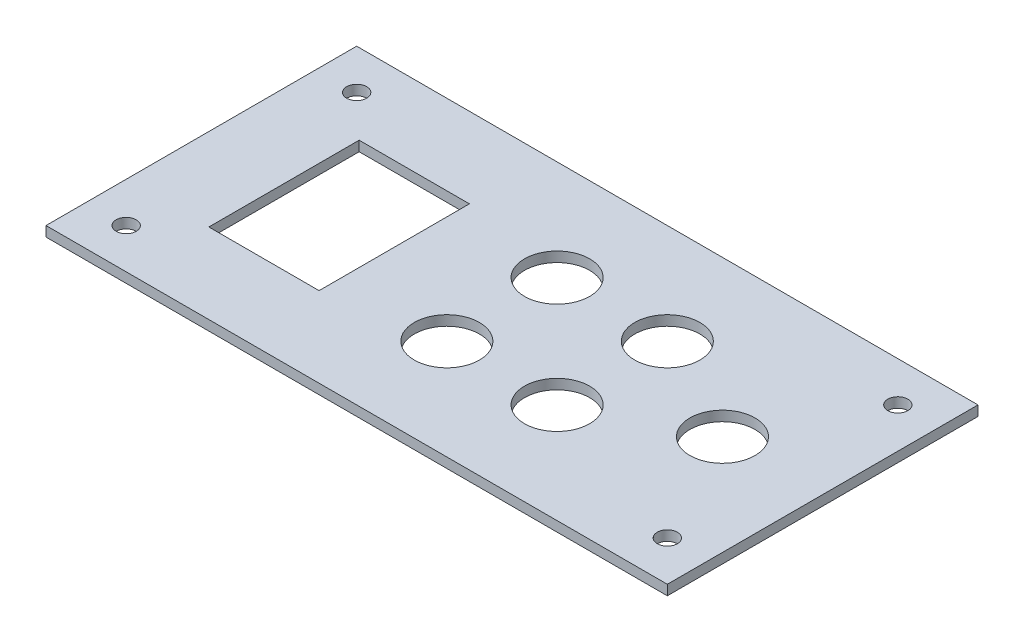
ISO-10303-21;
HEADER;
FILE_DESCRIPTION(('STEP AP214'),'2;1');
FILE_NAME('part.step','',(''),(''),'','','');
FILE_SCHEMA(('AUTOMOTIVE_DESIGN { 1 0 10303 214 1 1 1 1 }'));
ENDSEC;
DATA;
#1=APPLICATION_CONTEXT('core data for automotive mechanical design processes');
#2=APPLICATION_PROTOCOL_DEFINITION('international standard','automotive_design',2000,#1);
#3=PRODUCT_CONTEXT('',#1,'mechanical');
#4=PRODUCT('Part','Part','',(#3));
#5=PRODUCT_RELATED_PRODUCT_CATEGORY('part','',(#4));
#6=PRODUCT_DEFINITION_FORMATION('','',#4);
#7=PRODUCT_DEFINITION_CONTEXT('part definition',#1,'design');
#8=PRODUCT_DEFINITION('design','',#6,#7);
#9=PRODUCT_DEFINITION_SHAPE('','',#8);
#10=(LENGTH_UNIT() NAMED_UNIT(*) SI_UNIT(.MILLI.,.METRE.));
#11=(NAMED_UNIT(*) PLANE_ANGLE_UNIT() SI_UNIT($,.RADIAN.));
#12=(NAMED_UNIT(*) SI_UNIT($,.STERADIAN.) SOLID_ANGLE_UNIT());
#13=UNCERTAINTY_MEASURE_WITH_UNIT(LENGTH_MEASURE(1.E-05),#10,'distance_accuracy_value','');
#14=(GEOMETRIC_REPRESENTATION_CONTEXT(3) GLOBAL_UNCERTAINTY_ASSIGNED_CONTEXT((#13)) GLOBAL_UNIT_ASSIGNED_CONTEXT((#10,
#11,#12)) REPRESENTATION_CONTEXT('',''));
#15=CARTESIAN_POINT('',(0.,0.,0.));
#16=DIRECTION('',(0.,0.,1.));
#17=DIRECTION('',(1.,0.,0.));
#18=AXIS2_PLACEMENT_3D('',#15,#16,#17);
#19=CARTESIAN_POINT('',(0.,2.,0.));
#20=DIRECTION('',(0.,1.,0.));
#21=DIRECTION('',(0.,0.,1.));
#22=AXIS2_PLACEMENT_3D('',#19,#20,#21);
#23=PLANE('',#22);
#24=CARTESIAN_POINT('',(68.5,2.,23.));
#25=DIRECTION('',(0.,1.,0.));
#26=DIRECTION('',(0.,0.,-1.));
#27=AXIS2_PLACEMENT_3D('',#24,#25,#26);
#28=CIRCLE('',#27,2.);
#29=CARTESIAN_POINT('',(68.5,2.,21.));
#30=VERTEX_POINT('',#29);
#31=EDGE_CURVE('E315',#30,#30,#28,.T.);
#32=ORIENTED_EDGE('',*,*,#31,.F.);
#33=EDGE_LOOP('',(#32));
#34=FACE_BOUND('',#33,.T.);
#35=CARTESIAN_POINT('',(-39.5,2.,-23.));
#36=DIRECTION('',(0.,1.,0.));
#37=DIRECTION('',(0.,0.,1.));
#38=AXIS2_PLACEMENT_3D('',#35,#36,#37);
#39=CIRCLE('',#38,2.);
#40=CARTESIAN_POINT('',(-39.5,2.,-21.));
#41=VERTEX_POINT('',#40);
#42=EDGE_CURVE('E127',#41,#41,#39,.T.);
#43=ORIENTED_EDGE('',*,*,#42,.F.);
#44=EDGE_LOOP('',(#43));
#45=FACE_BOUND('',#44,.T.);
#46=CARTESIAN_POINT('',(34.5,2.,-11.));
#47=DIRECTION('',(0.,1.,0.));
#48=DIRECTION('',(0.,0.,1.));
#49=AXIS2_PLACEMENT_3D('',#46,#47,#48);
#50=CIRCLE('',#49,6.5);
#51=CARTESIAN_POINT('',(34.5,2.,-4.5));
#52=VERTEX_POINT('',#51);
#53=EDGE_CURVE('E143',#52,#52,#50,.T.);
#54=ORIENTED_EDGE('',*,*,#53,.F.);
#55=EDGE_LOOP('',(#54));
#56=FACE_BOUND('',#55,.T.);
#57=CARTESIAN_POINT('',(12.5,2.,11.));
#58=DIRECTION('',(0.,1.,0.));
#59=DIRECTION('',(0.,0.,1.));
#60=AXIS2_PLACEMENT_3D('',#57,#58,#59);
#61=CIRCLE('',#60,6.5);
#62=CARTESIAN_POINT('',(12.5,2.,17.5));
#63=VERTEX_POINT('',#62);
#64=EDGE_CURVE('E155',#63,#63,#61,.T.);
#65=ORIENTED_EDGE('',*,*,#64,.F.);
#66=EDGE_LOOP('',(#65));
#67=FACE_BOUND('',#66,.T.);
#68=DIRECTION('',(0.,0.,1.));
#69=VECTOR('',#68,1.);
#70=CARTESIAN_POINT('',(-47.5,2.,-31.));
#71=LINE('',#70,#69);
#72=CARTESIAN_POINT('',(-47.5,2.,-31.));
#73=VERTEX_POINT('',#72);
#74=CARTESIAN_POINT('',(-47.5,2.,31.));
#75=VERTEX_POINT('',#74);
#76=EDGE_CURVE('E167',#73,#75,#71,.T.);
#77=ORIENTED_EDGE('',*,*,#76,.T.);
#78=DIRECTION('',(1.,0.,0.));
#79=VECTOR('',#78,1.);
#80=CARTESIAN_POINT('',(-47.5,2.,31.));
#81=LINE('',#80,#79);
#82=CARTESIAN_POINT('',(76.5,2.,31.));
#83=VERTEX_POINT('',#82);
#84=EDGE_CURVE('E170',#75,#83,#81,.T.);
#85=ORIENTED_EDGE('',*,*,#84,.T.);
#86=DIRECTION('',(0.,0.,-1.));
#87=VECTOR('',#86,1.);
#88=CARTESIAN_POINT('',(76.5,2.,-31.));
#89=LINE('',#88,#87);
#90=CARTESIAN_POINT('',(76.5,2.,-31.));
#91=VERTEX_POINT('',#90);
#92=EDGE_CURVE('E173',#83,#91,#89,.T.);
#93=ORIENTED_EDGE('',*,*,#92,.T.);
#94=DIRECTION('',(-1.,0.,0.));
#95=VECTOR('',#94,1.);
#96=CARTESIAN_POINT('',(-47.5,2.,-31.));
#97=LINE('',#96,#95);
#98=EDGE_CURVE('E175',#91,#73,#97,.T.);
#99=ORIENTED_EDGE('',*,*,#98,.T.);
#100=EDGE_LOOP('',(#77,#85,#93,#99));
#101=FACE_BOUND('',#100,.T.);
#102=CARTESIAN_POINT('',(12.5,2.,-11.));
#103=DIRECTION('',(0.,1.,0.));
#104=DIRECTION('',(0.,0.,1.));
#105=AXIS2_PLACEMENT_3D('',#102,#103,#104);
#106=CIRCLE('',#105,6.5);
#107=CARTESIAN_POINT('',(12.5,2.,-4.5));
#108=VERTEX_POINT('',#107);
#109=EDGE_CURVE('E161',#108,#108,#106,.T.);
#110=ORIENTED_EDGE('',*,*,#109,.F.);
#111=EDGE_LOOP('',(#110));
#112=FACE_BOUND('',#111,.T.);
#113=CARTESIAN_POINT('',(56.5,2.,0.));
#114=DIRECTION('',(0.,1.,0.));
#115=DIRECTION('',(0.,0.,1.));
#116=AXIS2_PLACEMENT_3D('',#113,#114,#115);
#117=CIRCLE('',#116,6.5);
#118=CARTESIAN_POINT('',(56.5,2.,6.5));
#119=VERTEX_POINT('',#118);
#120=EDGE_CURVE('E149',#119,#119,#117,.T.);
#121=ORIENTED_EDGE('',*,*,#120,.F.);
#122=EDGE_LOOP('',(#121));
#123=FACE_BOUND('',#122,.T.);
#124=CARTESIAN_POINT('',(34.5,2.,11.));
#125=DIRECTION('',(0.,1.,0.));
#126=DIRECTION('',(0.,0.,1.));
#127=AXIS2_PLACEMENT_3D('',#124,#125,#126);
#128=CIRCLE('',#127,6.5);
#129=CARTESIAN_POINT('',(34.5,2.,17.5));
#130=VERTEX_POINT('',#129);
#131=EDGE_CURVE('E137',#130,#130,#128,.T.);
#132=ORIENTED_EDGE('',*,*,#131,.F.);
#133=EDGE_LOOP('',(#132));
#134=FACE_BOUND('',#133,.T.);
#135=DIRECTION('',(-1.,0.,0.));
#136=VECTOR('',#135,1.);
#137=CARTESIAN_POINT('',(-31.,2.,-15.));
#138=LINE('',#137,#136);
#139=CARTESIAN_POINT('',(-9.00000000000001,2.,-15.));
#140=VERTEX_POINT('',#139);
#141=CARTESIAN_POINT('',(-31.,2.,-15.));
#142=VERTEX_POINT('',#141);
#143=EDGE_CURVE('E106',#140,#142,#138,.T.);
#144=ORIENTED_EDGE('',*,*,#143,.F.);
#145=DIRECTION('',(0.,0.,-1.));
#146=VECTOR('',#145,1.);
#147=CARTESIAN_POINT('',(-9.00000000000001,2.,-15.));
#148=LINE('',#147,#146);
#149=CARTESIAN_POINT('',(-9.00000000000001,2.,15.));
#150=VERTEX_POINT('',#149);
#151=EDGE_CURVE('E98',#150,#140,#148,.T.);
#152=ORIENTED_EDGE('',*,*,#151,.F.);
#153=DIRECTION('',(1.,0.,0.));
#154=VECTOR('',#153,1.);
#155=CARTESIAN_POINT('',(-31.,2.,15.));
#156=LINE('',#155,#154);
#157=CARTESIAN_POINT('',(-31.,2.,15.));
#158=VERTEX_POINT('',#157);
#159=EDGE_CURVE('E121',#158,#150,#156,.T.);
#160=ORIENTED_EDGE('',*,*,#159,.F.);
#161=DIRECTION('',(0.,0.,1.));
#162=VECTOR('',#161,1.);
#163=CARTESIAN_POINT('',(-31.,2.,-15.));
#164=LINE('',#163,#162);
#165=EDGE_CURVE('E119',#142,#158,#164,.T.);
#166=ORIENTED_EDGE('',*,*,#165,.F.);
#167=EDGE_LOOP('',(#144,#152,#160,#166));
#168=FACE_BOUND('',#167,.T.);
#169=CARTESIAN_POINT('',(68.5,2.,-23.));
#170=DIRECTION('',(0.,1.,0.));
#171=DIRECTION('',(0.,0.,1.));
#172=AXIS2_PLACEMENT_3D('',#169,#170,#171);
#173=CIRCLE('',#172,2.);
#174=CARTESIAN_POINT('',(68.5,2.,-21.));
#175=VERTEX_POINT('',#174);
#176=EDGE_CURVE('E321',#175,#175,#173,.T.);
#177=ORIENTED_EDGE('',*,*,#176,.F.);
#178=EDGE_LOOP('',(#177));
#179=FACE_BOUND('',#178,.T.);
#180=CARTESIAN_POINT('',(-39.5,2.,23.));
#181=DIRECTION('',(0.,1.,0.));
#182=DIRECTION('',(0.,0.,-1.));
#183=AXIS2_PLACEMENT_3D('',#180,#181,#182);
#184=CIRCLE('',#183,2.);
#185=CARTESIAN_POINT('',(-39.5,2.,21.));
#186=VERTEX_POINT('',#185);
#187=EDGE_CURVE('E306',#186,#186,#184,.T.);
#188=ORIENTED_EDGE('',*,*,#187,.F.);
#189=EDGE_LOOP('',(#188));
#190=FACE_BOUND('',#189,.T.);
#191=ADVANCED_FACE('F33',(#34,#45,#56,#67,#101,#112,#123,#134,#168,#179,#190),#23,.T.);
#192=CARTESIAN_POINT('',(0.,0.,0.));
#193=DIRECTION('',(0.,1.,0.));
#194=DIRECTION('',(0.,0.,1.));
#195=AXIS2_PLACEMENT_3D('',#192,#193,#194);
#196=PLANE('',#195);
#197=CARTESIAN_POINT('',(34.5,0.,11.));
#198=DIRECTION('',(0.,1.,0.));
#199=DIRECTION('',(0.,0.,1.));
#200=AXIS2_PLACEMENT_3D('',#197,#198,#199);
#201=CIRCLE('',#200,6.5);
#202=CARTESIAN_POINT('',(34.5,0.,17.5));
#203=VERTEX_POINT('',#202);
#204=EDGE_CURVE('E114',#203,#203,#201,.T.);
#205=ORIENTED_EDGE('',*,*,#204,.T.);
#206=EDGE_LOOP('',(#205));
#207=FACE_BOUND('',#206,.T.);
#208=CARTESIAN_POINT('',(34.5,0.,-11.));
#209=DIRECTION('',(0.,1.,0.));
#210=DIRECTION('',(0.,0.,1.));
#211=AXIS2_PLACEMENT_3D('',#208,#209,#210);
#212=CIRCLE('',#211,6.5);
#213=CARTESIAN_POINT('',(34.5,0.,-4.5));
#214=VERTEX_POINT('',#213);
#215=EDGE_CURVE('E140',#214,#214,#212,.T.);
#216=ORIENTED_EDGE('',*,*,#215,.T.);
#217=EDGE_LOOP('',(#216));
#218=FACE_BOUND('',#217,.T.);
#219=CARTESIAN_POINT('',(56.5,0.,0.));
#220=DIRECTION('',(0.,1.,0.));
#221=DIRECTION('',(0.,0.,1.));
#222=AXIS2_PLACEMENT_3D('',#219,#220,#221);
#223=CIRCLE('',#222,6.5);
#224=CARTESIAN_POINT('',(56.5,0.,6.5));
#225=VERTEX_POINT('',#224);
#226=EDGE_CURVE('E146',#225,#225,#223,.T.);
#227=ORIENTED_EDGE('',*,*,#226,.T.);
#228=EDGE_LOOP('',(#227));
#229=FACE_BOUND('',#228,.T.);
#230=CARTESIAN_POINT('',(12.5,0.,11.));
#231=DIRECTION('',(0.,1.,0.));
#232=DIRECTION('',(0.,0.,1.));
#233=AXIS2_PLACEMENT_3D('',#230,#231,#232);
#234=CIRCLE('',#233,6.5);
#235=CARTESIAN_POINT('',(12.5,0.,17.5));
#236=VERTEX_POINT('',#235);
#237=EDGE_CURVE('E152',#236,#236,#234,.T.);
#238=ORIENTED_EDGE('',*,*,#237,.T.);
#239=EDGE_LOOP('',(#238));
#240=FACE_BOUND('',#239,.T.);
#241=CARTESIAN_POINT('',(12.5,0.,-11.));
#242=DIRECTION('',(0.,1.,0.));
#243=DIRECTION('',(0.,0.,1.));
#244=AXIS2_PLACEMENT_3D('',#241,#242,#243);
#245=CIRCLE('',#244,6.5);
#246=CARTESIAN_POINT('',(12.5,0.,-4.5));
#247=VERTEX_POINT('',#246);
#248=EDGE_CURVE('E158',#247,#247,#245,.T.);
#249=ORIENTED_EDGE('',*,*,#248,.T.);
#250=EDGE_LOOP('',(#249));
#251=FACE_BOUND('',#250,.T.);
#252=DIRECTION('',(0.,0.,1.));
#253=VECTOR('',#252,1.);
#254=CARTESIAN_POINT('',(-47.5,0.,-31.));
#255=LINE('',#254,#253);
#256=CARTESIAN_POINT('',(-47.5,0.,-31.));
#257=VERTEX_POINT('',#256);
#258=CARTESIAN_POINT('',(-47.5,0.,31.));
#259=VERTEX_POINT('',#258);
#260=EDGE_CURVE('E164',#257,#259,#255,.T.);
#261=ORIENTED_EDGE('',*,*,#260,.F.);
#262=DIRECTION('',(-1.,0.,0.));
#263=VECTOR('',#262,1.);
#264=CARTESIAN_POINT('',(-47.5,0.,-31.));
#265=LINE('',#264,#263);
#266=CARTESIAN_POINT('',(76.5,0.,-31.));
#267=VERTEX_POINT('',#266);
#268=EDGE_CURVE('E171',#267,#257,#265,.T.);
#269=ORIENTED_EDGE('',*,*,#268,.F.);
#270=DIRECTION('',(0.,0.,-1.));
#271=VECTOR('',#270,1.);
#272=CARTESIAN_POINT('',(76.5,0.,-31.));
#273=LINE('',#272,#271);
#274=CARTESIAN_POINT('',(76.5,0.,31.));
#275=VERTEX_POINT('',#274);
#276=EDGE_CURVE('E182',#275,#267,#273,.T.);
#277=ORIENTED_EDGE('',*,*,#276,.F.);
#278=DIRECTION('',(1.,0.,0.));
#279=VECTOR('',#278,1.);
#280=CARTESIAN_POINT('',(-47.5,0.,31.));
#281=LINE('',#280,#279);
#282=EDGE_CURVE('E180',#259,#275,#281,.T.);
#283=ORIENTED_EDGE('',*,*,#282,.F.);
#284=EDGE_LOOP('',(#261,#269,#277,#283));
#285=FACE_BOUND('',#284,.T.);
#286=DIRECTION('',(0.,0.,-1.));
#287=VECTOR('',#286,1.);
#288=CARTESIAN_POINT('',(-9.00000000000001,0.,-15.));
#289=LINE('',#288,#287);
#290=CARTESIAN_POINT('',(-9.00000000000001,0.,15.));
#291=VERTEX_POINT('',#290);
#292=CARTESIAN_POINT('',(-9.00000000000001,0.,-15.));
#293=VERTEX_POINT('',#292);
#294=EDGE_CURVE('E56',#291,#293,#289,.T.);
#295=ORIENTED_EDGE('',*,*,#294,.T.);
#296=DIRECTION('',(-1.,0.,0.));
#297=VECTOR('',#296,1.);
#298=CARTESIAN_POINT('',(-31.,0.,-15.));
#299=LINE('',#298,#297);
#300=CARTESIAN_POINT('',(-31.,0.,-15.));
#301=VERTEX_POINT('',#300);
#302=EDGE_CURVE('E113',#293,#301,#299,.T.);
#303=ORIENTED_EDGE('',*,*,#302,.T.);
#304=DIRECTION('',(0.,0.,1.));
#305=VECTOR('',#304,1.);
#306=CARTESIAN_POINT('',(-31.,0.,-15.));
#307=LINE('',#306,#305);
#308=CARTESIAN_POINT('',(-31.,0.,15.));
#309=VERTEX_POINT('',#308);
#310=EDGE_CURVE('E129',#301,#309,#307,.T.);
#311=ORIENTED_EDGE('',*,*,#310,.T.);
#312=DIRECTION('',(1.,0.,0.));
#313=VECTOR('',#312,1.);
#314=CARTESIAN_POINT('',(-31.,0.,15.));
#315=LINE('',#314,#313);
#316=EDGE_CURVE('E107',#309,#291,#315,.T.);
#317=ORIENTED_EDGE('',*,*,#316,.T.);
#318=EDGE_LOOP('',(#295,#303,#311,#317));
#319=FACE_BOUND('',#318,.T.);
#320=CARTESIAN_POINT('',(-39.5,0.,-23.));
#321=DIRECTION('',(0.,1.,0.));
#322=DIRECTION('',(0.,0.,1.));
#323=AXIS2_PLACEMENT_3D('',#320,#321,#322);
#324=CIRCLE('',#323,2.);
#325=CARTESIAN_POINT('',(-39.5,0.,-21.));
#326=VERTEX_POINT('',#325);
#327=EDGE_CURVE('E324',#326,#326,#324,.T.);
#328=ORIENTED_EDGE('',*,*,#327,.T.);
#329=EDGE_LOOP('',(#328));
#330=FACE_BOUND('',#329,.T.);
#331=CARTESIAN_POINT('',(68.5,0.,-23.));
#332=DIRECTION('',(0.,1.,0.));
#333=DIRECTION('',(0.,0.,1.));
#334=AXIS2_PLACEMENT_3D('',#331,#332,#333);
#335=CIRCLE('',#334,2.);
#336=CARTESIAN_POINT('',(68.5,0.,-21.));
#337=VERTEX_POINT('',#336);
#338=EDGE_CURVE('E318',#337,#337,#335,.T.);
#339=ORIENTED_EDGE('',*,*,#338,.T.);
#340=EDGE_LOOP('',(#339));
#341=FACE_BOUND('',#340,.T.);
#342=CARTESIAN_POINT('',(68.5,0.,23.));
#343=DIRECTION('',(0.,1.,0.));
#344=DIRECTION('',(0.,0.,-1.));
#345=AXIS2_PLACEMENT_3D('',#342,#343,#344);
#346=CIRCLE('',#345,2.);
#347=CARTESIAN_POINT('',(68.5,0.,21.));
#348=VERTEX_POINT('',#347);
#349=EDGE_CURVE('E312',#348,#348,#346,.T.);
#350=ORIENTED_EDGE('',*,*,#349,.T.);
#351=EDGE_LOOP('',(#350));
#352=FACE_BOUND('',#351,.T.);
#353=CARTESIAN_POINT('',(-39.5,0.,23.));
#354=DIRECTION('',(0.,1.,0.));
#355=DIRECTION('',(0.,0.,-1.));
#356=AXIS2_PLACEMENT_3D('',#353,#354,#355);
#357=CIRCLE('',#356,2.);
#358=CARTESIAN_POINT('',(-39.5,0.,21.));
#359=VERTEX_POINT('',#358);
#360=EDGE_CURVE('E309',#359,#359,#357,.T.);
#361=ORIENTED_EDGE('',*,*,#360,.T.);
#362=EDGE_LOOP('',(#361));
#363=FACE_BOUND('',#362,.T.);
#364=ADVANCED_FACE('F200',(#207,#218,#229,#240,#251,#285,#319,#330,#341,#352,#363),#196,.F.);
#365=CARTESIAN_POINT('',(-47.5,2.,-31.));
#366=DIRECTION('',(1.,0.,0.));
#367=DIRECTION('',(0.,0.,-1.));
#368=AXIS2_PLACEMENT_3D('',#365,#366,#367);
#369=PLANE('',#368);
#370=ORIENTED_EDGE('',*,*,#260,.T.);
#371=DIRECTION('',(0.,-1.,0.));
#372=VECTOR('',#371,1.);
#373=CARTESIAN_POINT('',(-47.5,2.,31.));
#374=LINE('',#373,#372);
#375=EDGE_CURVE('E11',#75,#259,#374,.T.);
#376=ORIENTED_EDGE('',*,*,#375,.F.);
#377=ORIENTED_EDGE('',*,*,#76,.F.);
#378=DIRECTION('',(0.,-1.,0.));
#379=VECTOR('',#378,1.);
#380=CARTESIAN_POINT('',(-47.5,2.,-31.));
#381=LINE('',#380,#379);
#382=EDGE_CURVE('E177',#73,#257,#381,.T.);
#383=ORIENTED_EDGE('',*,*,#382,.T.);
#384=EDGE_LOOP('',(#370,#376,#377,#383));
#385=FACE_BOUND('',#384,.T.);
#386=ADVANCED_FACE('F35',(#385),#369,.F.);
#387=CARTESIAN_POINT('',(-47.5,2.,31.));
#388=DIRECTION('',(0.,0.,-1.));
#389=DIRECTION('',(-1.,0.,0.));
#390=AXIS2_PLACEMENT_3D('',#387,#388,#389);
#391=PLANE('',#390);
#392=ORIENTED_EDGE('',*,*,#282,.T.);
#393=DIRECTION('',(0.,-1.,0.));
#394=VECTOR('',#393,1.);
#395=CARTESIAN_POINT('',(76.5,2.,31.));
#396=LINE('',#395,#394);
#397=EDGE_CURVE('E41',#83,#275,#396,.T.);
#398=ORIENTED_EDGE('',*,*,#397,.F.);
#399=ORIENTED_EDGE('',*,*,#84,.F.);
#400=ORIENTED_EDGE('',*,*,#375,.T.);
#401=EDGE_LOOP('',(#392,#398,#399,#400));
#402=FACE_BOUND('',#401,.T.);
#403=ADVANCED_FACE('F211',(#402),#391,.F.);
#404=CARTESIAN_POINT('',(76.5,2.,-31.));
#405=DIRECTION('',(-1.,0.,0.));
#406=DIRECTION('',(0.,0.,1.));
#407=AXIS2_PLACEMENT_3D('',#404,#405,#406);
#408=PLANE('',#407);
#409=ORIENTED_EDGE('',*,*,#276,.T.);
#410=DIRECTION('',(0.,-1.,0.));
#411=VECTOR('',#410,1.);
#412=CARTESIAN_POINT('',(76.5,2.,-31.));
#413=LINE('',#412,#411);
#414=EDGE_CURVE('E187',#91,#267,#413,.T.);
#415=ORIENTED_EDGE('',*,*,#414,.F.);
#416=ORIENTED_EDGE('',*,*,#92,.F.);
#417=ORIENTED_EDGE('',*,*,#397,.T.);
#418=EDGE_LOOP('',(#409,#415,#416,#417));
#419=FACE_BOUND('',#418,.T.);
#420=ADVANCED_FACE('F194',(#419),#408,.F.);
#421=CARTESIAN_POINT('',(-47.5,2.,-31.));
#422=DIRECTION('',(0.,0.,1.));
#423=DIRECTION('',(1.,0.,0.));
#424=AXIS2_PLACEMENT_3D('',#421,#422,#423);
#425=PLANE('',#424);
#426=ORIENTED_EDGE('',*,*,#268,.T.);
#427=ORIENTED_EDGE('',*,*,#382,.F.);
#428=ORIENTED_EDGE('',*,*,#98,.F.);
#429=ORIENTED_EDGE('',*,*,#414,.T.);
#430=EDGE_LOOP('',(#426,#427,#428,#429));
#431=FACE_BOUND('',#430,.T.);
#432=ADVANCED_FACE('F204',(#431),#425,.F.);
#433=CARTESIAN_POINT('',(12.5,2.,-11.));
#434=DIRECTION('',(0.,-1.,0.));
#435=DIRECTION('',(0.,0.,-1.));
#436=AXIS2_PLACEMENT_3D('',#433,#434,#435);
#437=CYLINDRICAL_SURFACE('',#436,6.5);
#438=ORIENTED_EDGE('',*,*,#109,.T.);
#439=EDGE_LOOP('',(#438));
#440=FACE_BOUND('',#439,.T.);
#441=ORIENTED_EDGE('',*,*,#248,.F.);
#442=EDGE_LOOP('',(#441));
#443=FACE_BOUND('',#442,.T.);
#444=ADVANCED_FACE('F229',(#440,#443),#437,.F.);
#445=CARTESIAN_POINT('',(12.5,2.,11.));
#446=DIRECTION('',(0.,-1.,0.));
#447=DIRECTION('',(0.,0.,-1.));
#448=AXIS2_PLACEMENT_3D('',#445,#446,#447);
#449=CYLINDRICAL_SURFACE('',#448,6.5);
#450=ORIENTED_EDGE('',*,*,#64,.T.);
#451=EDGE_LOOP('',(#450));
#452=FACE_BOUND('',#451,.T.);
#453=ORIENTED_EDGE('',*,*,#237,.F.);
#454=EDGE_LOOP('',(#453));
#455=FACE_BOUND('',#454,.T.);
#456=ADVANCED_FACE('F236',(#452,#455),#449,.F.);
#457=CARTESIAN_POINT('',(56.5,2.,0.));
#458=DIRECTION('',(0.,-1.,0.));
#459=DIRECTION('',(0.,0.,-1.));
#460=AXIS2_PLACEMENT_3D('',#457,#458,#459);
#461=CYLINDRICAL_SURFACE('',#460,6.5);
#462=ORIENTED_EDGE('',*,*,#120,.T.);
#463=EDGE_LOOP('',(#462));
#464=FACE_BOUND('',#463,.T.);
#465=ORIENTED_EDGE('',*,*,#226,.F.);
#466=EDGE_LOOP('',(#465));
#467=FACE_BOUND('',#466,.T.);
#468=ADVANCED_FACE('F241',(#464,#467),#461,.F.);
#469=CARTESIAN_POINT('',(34.5,2.,-11.));
#470=DIRECTION('',(0.,-1.,0.));
#471=DIRECTION('',(0.,0.,-1.));
#472=AXIS2_PLACEMENT_3D('',#469,#470,#471);
#473=CYLINDRICAL_SURFACE('',#472,6.5);
#474=ORIENTED_EDGE('',*,*,#53,.T.);
#475=EDGE_LOOP('',(#474));
#476=FACE_BOUND('',#475,.T.);
#477=ORIENTED_EDGE('',*,*,#215,.F.);
#478=EDGE_LOOP('',(#477));
#479=FACE_BOUND('',#478,.T.);
#480=ADVANCED_FACE('F255',(#476,#479),#473,.F.);
#481=CARTESIAN_POINT('',(34.5,2.,11.));
#482=DIRECTION('',(0.,-1.,0.));
#483=DIRECTION('',(0.,0.,-1.));
#484=AXIS2_PLACEMENT_3D('',#481,#482,#483);
#485=CYLINDRICAL_SURFACE('',#484,6.5);
#486=ORIENTED_EDGE('',*,*,#131,.T.);
#487=EDGE_LOOP('',(#486));
#488=FACE_BOUND('',#487,.T.);
#489=ORIENTED_EDGE('',*,*,#204,.F.);
#490=EDGE_LOOP('',(#489));
#491=FACE_BOUND('',#490,.T.);
#492=ADVANCED_FACE('F252',(#488,#491),#485,.F.);
#493=CARTESIAN_POINT('',(-9.00000000000001,2.,-15.));
#494=DIRECTION('',(-1.,0.,0.));
#495=DIRECTION('',(0.,0.,1.));
#496=AXIS2_PLACEMENT_3D('',#493,#494,#495);
#497=PLANE('',#496);
#498=ORIENTED_EDGE('',*,*,#294,.F.);
#499=DIRECTION('',(0.,-1.,0.));
#500=VECTOR('',#499,1.);
#501=CARTESIAN_POINT('',(-9.00000000000001,2.,15.));
#502=LINE('',#501,#500);
#503=EDGE_CURVE('E102',#150,#291,#502,.T.);
#504=ORIENTED_EDGE('',*,*,#503,.F.);
#505=ORIENTED_EDGE('',*,*,#151,.T.);
#506=DIRECTION('',(0.,-1.,0.));
#507=VECTOR('',#506,1.);
#508=CARTESIAN_POINT('',(-9.00000000000001,2.,-15.));
#509=LINE('',#508,#507);
#510=EDGE_CURVE('E101',#140,#293,#509,.T.);
#511=ORIENTED_EDGE('',*,*,#510,.T.);
#512=EDGE_LOOP('',(#498,#504,#505,#511));
#513=FACE_BOUND('',#512,.T.);
#514=ADVANCED_FACE('F100',(#513),#497,.T.);
#515=CARTESIAN_POINT('',(-31.,2.,-15.));
#516=DIRECTION('',(0.,0.,1.));
#517=DIRECTION('',(1.,0.,0.));
#518=AXIS2_PLACEMENT_3D('',#515,#516,#517);
#519=PLANE('',#518);
#520=ORIENTED_EDGE('',*,*,#302,.F.);
#521=ORIENTED_EDGE('',*,*,#510,.F.);
#522=ORIENTED_EDGE('',*,*,#143,.T.);
#523=DIRECTION('',(0.,-1.,0.));
#524=VECTOR('',#523,1.);
#525=CARTESIAN_POINT('',(-31.,2.,-15.));
#526=LINE('',#525,#524);
#527=EDGE_CURVE('E115',#142,#301,#526,.T.);
#528=ORIENTED_EDGE('',*,*,#527,.T.);
#529=EDGE_LOOP('',(#520,#521,#522,#528));
#530=FACE_BOUND('',#529,.T.);
#531=ADVANCED_FACE('F110',(#530),#519,.T.);
#532=CARTESIAN_POINT('',(-31.,2.,-15.));
#533=DIRECTION('',(1.,0.,0.));
#534=DIRECTION('',(0.,0.,-1.));
#535=AXIS2_PLACEMENT_3D('',#532,#533,#534);
#536=PLANE('',#535);
#537=ORIENTED_EDGE('',*,*,#310,.F.);
#538=ORIENTED_EDGE('',*,*,#527,.F.);
#539=ORIENTED_EDGE('',*,*,#165,.T.);
#540=DIRECTION('',(0.,-1.,0.));
#541=VECTOR('',#540,1.);
#542=CARTESIAN_POINT('',(-31.,2.,15.));
#543=LINE('',#542,#541);
#544=EDGE_CURVE('E48',#158,#309,#543,.T.);
#545=ORIENTED_EDGE('',*,*,#544,.T.);
#546=EDGE_LOOP('',(#537,#538,#539,#545));
#547=FACE_BOUND('',#546,.T.);
#548=ADVANCED_FACE('F279',(#547),#536,.T.);
#549=CARTESIAN_POINT('',(-31.,2.,15.));
#550=DIRECTION('',(0.,0.,-1.));
#551=DIRECTION('',(-1.,0.,0.));
#552=AXIS2_PLACEMENT_3D('',#549,#550,#551);
#553=PLANE('',#552);
#554=ORIENTED_EDGE('',*,*,#316,.F.);
#555=ORIENTED_EDGE('',*,*,#544,.F.);
#556=ORIENTED_EDGE('',*,*,#159,.T.);
#557=ORIENTED_EDGE('',*,*,#503,.T.);
#558=EDGE_LOOP('',(#554,#555,#556,#557));
#559=FACE_BOUND('',#558,.T.);
#560=ADVANCED_FACE('F282',(#559),#553,.T.);
#561=CARTESIAN_POINT('',(-39.5,2.,-23.));
#562=DIRECTION('',(0.,-1.,0.));
#563=DIRECTION('',(0.,0.,-1.));
#564=AXIS2_PLACEMENT_3D('',#561,#562,#563);
#565=CYLINDRICAL_SURFACE('',#564,2.);
#566=ORIENTED_EDGE('',*,*,#42,.T.);
#567=EDGE_LOOP('',(#566));
#568=FACE_BOUND('',#567,.T.);
#569=ORIENTED_EDGE('',*,*,#327,.F.);
#570=EDGE_LOOP('',(#569));
#571=FACE_BOUND('',#570,.T.);
#572=ADVANCED_FACE('F286',(#568,#571),#565,.F.);
#573=CARTESIAN_POINT('',(68.5,2.,-23.));
#574=DIRECTION('',(0.,-1.,0.));
#575=DIRECTION('',(0.,0.,-1.));
#576=AXIS2_PLACEMENT_3D('',#573,#574,#575);
#577=CYLINDRICAL_SURFACE('',#576,2.);
#578=ORIENTED_EDGE('',*,*,#176,.T.);
#579=EDGE_LOOP('',(#578));
#580=FACE_BOUND('',#579,.T.);
#581=ORIENTED_EDGE('',*,*,#338,.F.);
#582=EDGE_LOOP('',(#581));
#583=FACE_BOUND('',#582,.T.);
#584=ADVANCED_FACE('F289',(#580,#583),#577,.F.);
#585=CARTESIAN_POINT('',(68.5,2.,23.));
#586=DIRECTION('',(0.,-1.,0.));
#587=DIRECTION('',(0.,0.,-1.));
#588=AXIS2_PLACEMENT_3D('',#585,#586,#587);
#589=CYLINDRICAL_SURFACE('',#588,2.);
#590=ORIENTED_EDGE('',*,*,#31,.T.);
#591=EDGE_LOOP('',(#590));
#592=FACE_BOUND('',#591,.T.);
#593=ORIENTED_EDGE('',*,*,#349,.F.);
#594=EDGE_LOOP('',(#593));
#595=FACE_BOUND('',#594,.T.);
#596=ADVANCED_FACE('F293',(#592,#595),#589,.F.);
#597=CARTESIAN_POINT('',(-39.5,2.,23.));
#598=DIRECTION('',(0.,-1.,0.));
#599=DIRECTION('',(0.,0.,-1.));
#600=AXIS2_PLACEMENT_3D('',#597,#598,#599);
#601=CYLINDRICAL_SURFACE('',#600,2.);
#602=ORIENTED_EDGE('',*,*,#187,.T.);
#603=EDGE_LOOP('',(#602));
#604=FACE_BOUND('',#603,.T.);
#605=ORIENTED_EDGE('',*,*,#360,.F.);
#606=EDGE_LOOP('',(#605));
#607=FACE_BOUND('',#606,.T.);
#608=ADVANCED_FACE('F297',(#604,#607),#601,.F.);
#609=CLOSED_SHELL('',(#191,#364,#386,#403,#420,#432,#444,#456,#468,#480,#492,#514,#531,#548,
#560,#572,#584,#596,#608));
#610=MANIFOLD_SOLID_BREP('B2',#609);
#611=ADVANCED_BREP_SHAPE_REPRESENTATION('',(#18,#610),#14);
#612=SHAPE_DEFINITION_REPRESENTATION(#9,#611);
ENDSEC;
END-ISO-10303-21;
